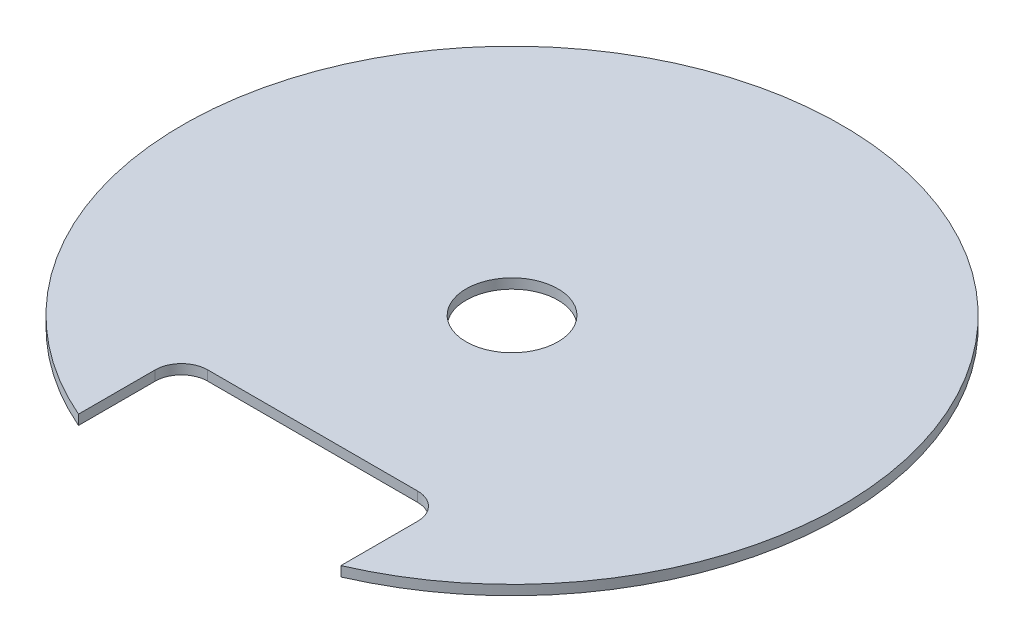
ISO-10303-21;
HEADER;
FILE_DESCRIPTION(('STEP AP214'),'2;1');
FILE_NAME('part.step','',(''),(''),'','','');
FILE_SCHEMA(('AUTOMOTIVE_DESIGN { 1 0 10303 214 1 1 1 1 }'));
ENDSEC;
DATA;
#1=APPLICATION_CONTEXT('core data for automotive mechanical design processes');
#2=APPLICATION_PROTOCOL_DEFINITION('international standard','automotive_design',2000,#1);
#3=PRODUCT_CONTEXT('',#1,'mechanical');
#4=PRODUCT('Part','Part','',(#3));
#5=PRODUCT_RELATED_PRODUCT_CATEGORY('part','',(#4));
#6=PRODUCT_DEFINITION_FORMATION('','',#4);
#7=PRODUCT_DEFINITION_CONTEXT('part definition',#1,'design');
#8=PRODUCT_DEFINITION('design','',#6,#7);
#9=PRODUCT_DEFINITION_SHAPE('','',#8);
#10=(LENGTH_UNIT() NAMED_UNIT(*) SI_UNIT(.MILLI.,.METRE.));
#11=(NAMED_UNIT(*) PLANE_ANGLE_UNIT() SI_UNIT($,.RADIAN.));
#12=(NAMED_UNIT(*) SI_UNIT($,.STERADIAN.) SOLID_ANGLE_UNIT());
#13=UNCERTAINTY_MEASURE_WITH_UNIT(LENGTH_MEASURE(1.E-05),#10,'distance_accuracy_value','');
#14=(GEOMETRIC_REPRESENTATION_CONTEXT(3) GLOBAL_UNCERTAINTY_ASSIGNED_CONTEXT((#13)) GLOBAL_UNIT_ASSIGNED_CONTEXT((#10,
#11,#12)) REPRESENTATION_CONTEXT('',''));
#15=CARTESIAN_POINT('',(0.,0.,0.));
#16=DIRECTION('',(0.,0.,1.));
#17=DIRECTION('',(1.,0.,0.));
#18=AXIS2_PLACEMENT_3D('',#15,#16,#17);
#19=CARTESIAN_POINT('',(0.,-1.5,0.));
#20=DIRECTION('',(0.,1.,0.));
#21=DIRECTION('',(0.,0.,1.));
#22=AXIS2_PLACEMENT_3D('',#19,#20,#21);
#23=CYLINDRICAL_SURFACE('',#22,50.25);
#24=DIRECTION('',(0.,1.,0.));
#25=VECTOR('',#24,1.);
#26=CARTESIAN_POINT('',(20.,-1.5,46.0984001891606));
#27=LINE('',#26,#25);
#28=CARTESIAN_POINT('',(20.,-1.5,46.0984001891606));
#29=VERTEX_POINT('',#28);
#30=CARTESIAN_POINT('',(20.,0.,46.0984001891606));
#31=VERTEX_POINT('',#30);
#32=EDGE_CURVE('E131',#29,#31,#27,.T.);
#33=ORIENTED_EDGE('',*,*,#32,.F.);
#34=CARTESIAN_POINT('',(0.,-1.5,0.));
#35=DIRECTION('',(0.,1.,0.));
#36=DIRECTION('',(0.,0.,1.));
#37=AXIS2_PLACEMENT_3D('',#34,#35,#36);
#38=CIRCLE('',#37,50.25);
#39=CARTESIAN_POINT('',(-20.,-1.5,46.0984001891606));
#40=VERTEX_POINT('',#39);
#41=EDGE_CURVE('E44',#29,#40,#38,.T.);
#42=ORIENTED_EDGE('',*,*,#41,.T.);
#43=DIRECTION('',(0.,1.,0.));
#44=VECTOR('',#43,1.);
#45=CARTESIAN_POINT('',(-20.,-1.5,46.0984001891606));
#46=LINE('',#45,#44);
#47=CARTESIAN_POINT('',(-20.,0.,46.0984001891606));
#48=VERTEX_POINT('',#47);
#49=EDGE_CURVE('E101',#48,#40,#46,.F.);
#50=ORIENTED_EDGE('',*,*,#49,.F.);
#51=CARTESIAN_POINT('',(0.,0.,0.));
#52=DIRECTION('',(0.,1.,0.));
#53=DIRECTION('',(0.,0.,1.));
#54=AXIS2_PLACEMENT_3D('',#51,#52,#53);
#55=CIRCLE('',#54,50.25);
#56=EDGE_CURVE('E137',#31,#48,#55,.T.);
#57=ORIENTED_EDGE('',*,*,#56,.F.);
#58=EDGE_LOOP('',(#33,#42,#50,#57));
#59=FACE_BOUND('',#58,.T.);
#60=ADVANCED_FACE('F37',(#59),#23,.T.);
#61=CARTESIAN_POINT('',(0.,-1.5,0.));
#62=DIRECTION('',(0.,1.,0.));
#63=DIRECTION('',(0.,0.,1.));
#64=AXIS2_PLACEMENT_3D('',#61,#62,#63);
#65=PLANE('',#64);
#66=CARTESIAN_POINT('',(0.,-1.5,0.));
#67=DIRECTION('',(0.,1.,0.));
#68=DIRECTION('',(0.,0.,1.));
#69=AXIS2_PLACEMENT_3D('',#66,#67,#68);
#70=CIRCLE('',#69,7.);
#71=CARTESIAN_POINT('',(0.,-1.5,7.));
#72=VERTEX_POINT('',#71);
#73=EDGE_CURVE('E134',#72,#72,#70,.T.);
#74=ORIENTED_EDGE('',*,*,#73,.T.);
#75=EDGE_LOOP('',(#74));
#76=FACE_BOUND('',#75,.T.);
#77=ORIENTED_EDGE('',*,*,#41,.F.);
#78=DIRECTION('',(0.,0.,-1.));
#79=VECTOR('',#78,1.);
#80=CARTESIAN_POINT('',(20.,-1.5,34.4));
#81=LINE('',#80,#79);
#82=CARTESIAN_POINT('',(20.,-1.5,34.4));
#83=VERTEX_POINT('',#82);
#84=EDGE_CURVE('E59',#29,#83,#81,.T.);
#85=ORIENTED_EDGE('',*,*,#84,.T.);
#86=CARTESIAN_POINT('',(16.,-1.5,34.4));
#87=DIRECTION('',(0.,1.,0.));
#88=DIRECTION('',(0.,0.,1.));
#89=AXIS2_PLACEMENT_3D('',#86,#87,#88);
#90=CIRCLE('',#89,4.);
#91=CARTESIAN_POINT('',(16.,-1.5,30.4));
#92=VERTEX_POINT('',#91);
#93=EDGE_CURVE('E116',#83,#92,#90,.T.);
#94=ORIENTED_EDGE('',*,*,#93,.T.);
#95=DIRECTION('',(-1.,0.,0.));
#96=VECTOR('',#95,1.);
#97=CARTESIAN_POINT('',(-16.,-1.5,30.4));
#98=LINE('',#97,#96);
#99=CARTESIAN_POINT('',(-16.,-1.5,30.4));
#100=VERTEX_POINT('',#99);
#101=EDGE_CURVE('E95',#92,#100,#98,.T.);
#102=ORIENTED_EDGE('',*,*,#101,.T.);
#103=CARTESIAN_POINT('',(-16.,-1.5,34.4));
#104=DIRECTION('',(0.,1.,0.));
#105=DIRECTION('',(0.,0.,1.));
#106=AXIS2_PLACEMENT_3D('',#103,#104,#105);
#107=CIRCLE('',#106,4.);
#108=CARTESIAN_POINT('',(-20.,-1.5,34.4));
#109=VERTEX_POINT('',#108);
#110=EDGE_CURVE('E90',#100,#109,#107,.T.);
#111=ORIENTED_EDGE('',*,*,#110,.T.);
#112=DIRECTION('',(0.,0.,1.));
#113=VECTOR('',#112,1.);
#114=CARTESIAN_POINT('',(-20.,-1.5,46.2618633433631));
#115=LINE('',#114,#113);
#116=EDGE_CURVE('E98',#109,#40,#115,.T.);
#117=ORIENTED_EDGE('',*,*,#116,.T.);
#118=EDGE_LOOP('',(#77,#85,#94,#102,#111,#117));
#119=FACE_BOUND('',#118,.T.);
#120=ADVANCED_FACE('F106',(#76,#119),#65,.F.);
#121=CARTESIAN_POINT('',(0.,0.,0.));
#122=DIRECTION('',(0.,1.,0.));
#123=DIRECTION('',(0.,0.,1.));
#124=AXIS2_PLACEMENT_3D('',#121,#122,#123);
#125=PLANE('',#124);
#126=DIRECTION('',(0.,0.,-1.));
#127=VECTOR('',#126,1.);
#128=CARTESIAN_POINT('',(20.,0.,0.));
#129=LINE('',#128,#127);
#130=CARTESIAN_POINT('',(20.,0.,34.4));
#131=VERTEX_POINT('',#130);
#132=EDGE_CURVE('E11',#31,#131,#129,.T.);
#133=ORIENTED_EDGE('',*,*,#132,.F.);
#134=ORIENTED_EDGE('',*,*,#56,.T.);
#135=DIRECTION('',(0.,0.,1.));
#136=VECTOR('',#135,1.);
#137=CARTESIAN_POINT('',(-20.,0.,46.2618633433631));
#138=LINE('',#137,#136);
#139=CARTESIAN_POINT('',(-20.,0.,34.4));
#140=VERTEX_POINT('',#139);
#141=EDGE_CURVE('E120',#140,#48,#138,.T.);
#142=ORIENTED_EDGE('',*,*,#141,.F.);
#143=CARTESIAN_POINT('',(-16.,0.,34.4));
#144=DIRECTION('',(0.,1.,0.));
#145=DIRECTION('',(0.,0.,1.));
#146=AXIS2_PLACEMENT_3D('',#143,#144,#145);
#147=CIRCLE('',#146,4.);
#148=CARTESIAN_POINT('',(-16.,0.,30.4));
#149=VERTEX_POINT('',#148);
#150=EDGE_CURVE('E51',#149,#140,#147,.T.);
#151=ORIENTED_EDGE('',*,*,#150,.F.);
#152=DIRECTION('',(-1.,0.,0.));
#153=VECTOR('',#152,1.);
#154=CARTESIAN_POINT('',(-16.,0.,30.4));
#155=LINE('',#154,#153);
#156=CARTESIAN_POINT('',(16.,0.,30.4));
#157=VERTEX_POINT('',#156);
#158=EDGE_CURVE('E109',#157,#149,#155,.T.);
#159=ORIENTED_EDGE('',*,*,#158,.F.);
#160=CARTESIAN_POINT('',(16.,0.,34.4));
#161=DIRECTION('',(0.,1.,0.));
#162=DIRECTION('',(0.,0.,1.));
#163=AXIS2_PLACEMENT_3D('',#160,#161,#162);
#164=CIRCLE('',#163,4.);
#165=EDGE_CURVE('E112',#131,#157,#164,.T.);
#166=ORIENTED_EDGE('',*,*,#165,.F.);
#167=EDGE_LOOP('',(#133,#134,#142,#151,#159,#166));
#168=FACE_BOUND('',#167,.T.);
#169=CARTESIAN_POINT('',(0.,0.,0.));
#170=DIRECTION('',(0.,1.,0.));
#171=DIRECTION('',(0.,0.,1.));
#172=AXIS2_PLACEMENT_3D('',#169,#170,#171);
#173=CIRCLE('',#172,7.);
#174=CARTESIAN_POINT('',(0.,0.,7.));
#175=VERTEX_POINT('',#174);
#176=EDGE_CURVE('E133',#175,#175,#173,.T.);
#177=ORIENTED_EDGE('',*,*,#176,.F.);
#178=EDGE_LOOP('',(#177));
#179=FACE_BOUND('',#178,.T.);
#180=ADVANCED_FACE('F144',(#168,#179),#125,.T.);
#181=CARTESIAN_POINT('',(0.,-1.5,0.));
#182=DIRECTION('',(0.,1.,0.));
#183=DIRECTION('',(0.,0.,1.));
#184=AXIS2_PLACEMENT_3D('',#181,#182,#183);
#185=CYLINDRICAL_SURFACE('',#184,7.);
#186=ORIENTED_EDGE('',*,*,#73,.F.);
#187=EDGE_LOOP('',(#186));
#188=FACE_BOUND('',#187,.T.);
#189=ORIENTED_EDGE('',*,*,#176,.T.);
#190=EDGE_LOOP('',(#189));
#191=FACE_BOUND('',#190,.T.);
#192=ADVANCED_FACE('F162',(#188,#191),#185,.F.);
#193=CARTESIAN_POINT('',(-16.,-1.5,34.4));
#194=DIRECTION('',(0.,1.,0.));
#195=DIRECTION('',(0.,0.,1.));
#196=AXIS2_PLACEMENT_3D('',#193,#194,#195);
#197=CYLINDRICAL_SURFACE('',#196,4.);
#198=ORIENTED_EDGE('',*,*,#150,.T.);
#199=DIRECTION('',(0.,1.,0.));
#200=VECTOR('',#199,1.);
#201=CARTESIAN_POINT('',(-20.,-1.5,34.4));
#202=LINE('',#201,#200);
#203=EDGE_CURVE('E86',#109,#140,#202,.T.);
#204=ORIENTED_EDGE('',*,*,#203,.F.);
#205=ORIENTED_EDGE('',*,*,#110,.F.);
#206=DIRECTION('',(0.,1.,0.));
#207=VECTOR('',#206,1.);
#208=CARTESIAN_POINT('',(-16.,-1.5,30.4));
#209=LINE('',#208,#207);
#210=EDGE_CURVE('E124',#100,#149,#209,.T.);
#211=ORIENTED_EDGE('',*,*,#210,.T.);
#212=EDGE_LOOP('',(#198,#204,#205,#211));
#213=FACE_BOUND('',#212,.T.);
#214=ADVANCED_FACE('F88',(#213),#197,.F.);
#215=CARTESIAN_POINT('',(-16.,-1.5,30.4));
#216=DIRECTION('',(0.,0.,-1.));
#217=DIRECTION('',(-1.,0.,0.));
#218=AXIS2_PLACEMENT_3D('',#215,#216,#217);
#219=PLANE('',#218);
#220=ORIENTED_EDGE('',*,*,#158,.T.);
#221=ORIENTED_EDGE('',*,*,#210,.F.);
#222=ORIENTED_EDGE('',*,*,#101,.F.);
#223=DIRECTION('',(0.,1.,0.));
#224=VECTOR('',#223,1.);
#225=CARTESIAN_POINT('',(16.,-1.5,30.4));
#226=LINE('',#225,#224);
#227=EDGE_CURVE('E126',#92,#157,#226,.T.);
#228=ORIENTED_EDGE('',*,*,#227,.T.);
#229=EDGE_LOOP('',(#220,#221,#222,#228));
#230=FACE_BOUND('',#229,.T.);
#231=ADVANCED_FACE('F153',(#230),#219,.F.);
#232=CARTESIAN_POINT('',(16.,-1.5,34.4));
#233=DIRECTION('',(0.,1.,0.));
#234=DIRECTION('',(0.,0.,1.));
#235=AXIS2_PLACEMENT_3D('',#232,#233,#234);
#236=CYLINDRICAL_SURFACE('',#235,4.);
#237=ORIENTED_EDGE('',*,*,#165,.T.);
#238=ORIENTED_EDGE('',*,*,#227,.F.);
#239=ORIENTED_EDGE('',*,*,#93,.F.);
#240=DIRECTION('',(0.,1.,0.));
#241=VECTOR('',#240,1.);
#242=CARTESIAN_POINT('',(20.,-1.5,34.4));
#243=LINE('',#242,#241);
#244=EDGE_CURVE('E94',#83,#131,#243,.T.);
#245=ORIENTED_EDGE('',*,*,#244,.T.);
#246=EDGE_LOOP('',(#237,#238,#239,#245));
#247=FACE_BOUND('',#246,.T.);
#248=ADVANCED_FACE('F150',(#247),#236,.F.);
#249=CARTESIAN_POINT('',(20.,-1.5,34.4));
#250=DIRECTION('',(1.,0.,0.));
#251=DIRECTION('',(0.,0.,-1.));
#252=AXIS2_PLACEMENT_3D('',#249,#250,#251);
#253=PLANE('',#252);
#254=ORIENTED_EDGE('',*,*,#32,.T.);
#255=ORIENTED_EDGE('',*,*,#132,.T.);
#256=ORIENTED_EDGE('',*,*,#244,.F.);
#257=ORIENTED_EDGE('',*,*,#84,.F.);
#258=EDGE_LOOP('',(#254,#255,#256,#257));
#259=FACE_BOUND('',#258,.T.);
#260=ADVANCED_FACE('F160',(#259),#253,.F.);
#261=CARTESIAN_POINT('',(-20.,-1.5,46.2618633433631));
#262=DIRECTION('',(-1.,0.,0.));
#263=DIRECTION('',(0.,0.,1.));
#264=AXIS2_PLACEMENT_3D('',#261,#262,#263);
#265=PLANE('',#264);
#266=ORIENTED_EDGE('',*,*,#49,.T.);
#267=ORIENTED_EDGE('',*,*,#116,.F.);
#268=ORIENTED_EDGE('',*,*,#203,.T.);
#269=ORIENTED_EDGE('',*,*,#141,.T.);
#270=EDGE_LOOP('',(#266,#267,#268,#269));
#271=FACE_BOUND('',#270,.T.);
#272=ADVANCED_FACE('F99',(#271),#265,.F.);
#273=CLOSED_SHELL('',(#60,#120,#180,#192,#214,#231,#248,#260,#272));
#274=MANIFOLD_SOLID_BREP('B2',#273);
#275=ADVANCED_BREP_SHAPE_REPRESENTATION('',(#18,#274),#14);
#276=SHAPE_DEFINITION_REPRESENTATION(#9,#275);
ENDSEC;
END-ISO-10303-21;
